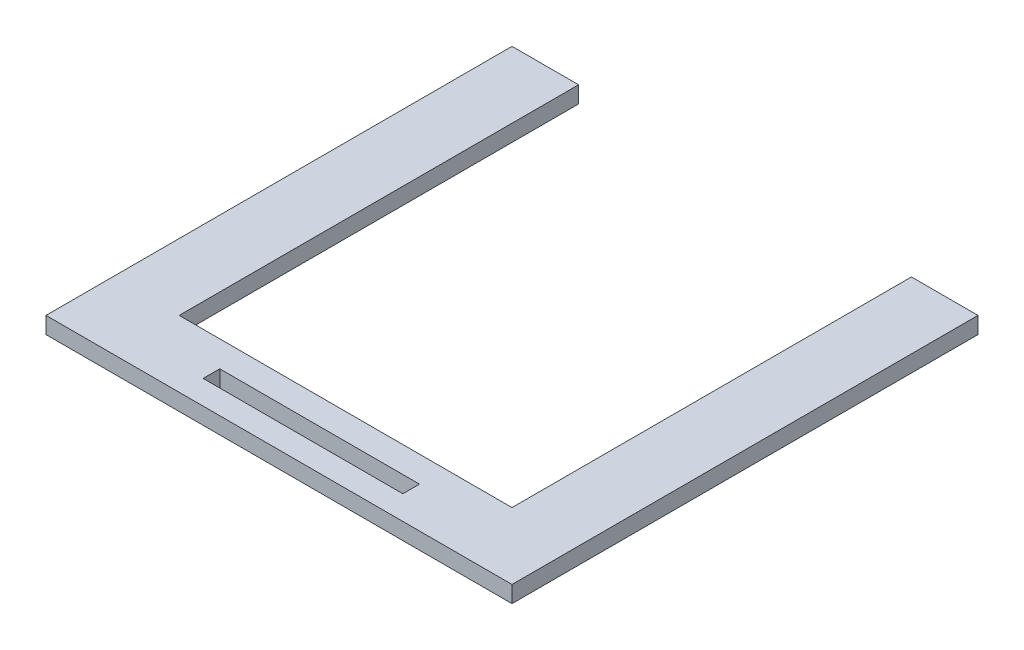
ISO-10303-21;
HEADER;
FILE_DESCRIPTION(('STEP AP214'),'2;1');
FILE_NAME('part.step','',(''),(''),'','','');
FILE_SCHEMA(('AUTOMOTIVE_DESIGN { 1 0 10303 214 1 1 1 1 }'));
ENDSEC;
DATA;
#1=APPLICATION_CONTEXT('core data for automotive mechanical design processes');
#2=APPLICATION_PROTOCOL_DEFINITION('international standard','automotive_design',2000,#1);
#3=PRODUCT_CONTEXT('',#1,'mechanical');
#4=PRODUCT('Part','Part','',(#3));
#5=PRODUCT_RELATED_PRODUCT_CATEGORY('part','',(#4));
#6=PRODUCT_DEFINITION_FORMATION('','',#4);
#7=PRODUCT_DEFINITION_CONTEXT('part definition',#1,'design');
#8=PRODUCT_DEFINITION('design','',#6,#7);
#9=PRODUCT_DEFINITION_SHAPE('','',#8);
#10=(LENGTH_UNIT() NAMED_UNIT(*) SI_UNIT(.MILLI.,.METRE.));
#11=(NAMED_UNIT(*) PLANE_ANGLE_UNIT() SI_UNIT($,.RADIAN.));
#12=(NAMED_UNIT(*) SI_UNIT($,.STERADIAN.) SOLID_ANGLE_UNIT());
#13=UNCERTAINTY_MEASURE_WITH_UNIT(LENGTH_MEASURE(1.E-05),#10,'distance_accuracy_value','');
#14=(GEOMETRIC_REPRESENTATION_CONTEXT(3) GLOBAL_UNCERTAINTY_ASSIGNED_CONTEXT((#13)) GLOBAL_UNIT_ASSIGNED_CONTEXT((#10,
#11,#12)) REPRESENTATION_CONTEXT('',''));
#15=CARTESIAN_POINT('',(0.,0.,0.));
#16=DIRECTION('',(0.,0.,1.));
#17=DIRECTION('',(1.,0.,0.));
#18=AXIS2_PLACEMENT_3D('',#15,#16,#17);
#19=CARTESIAN_POINT('',(32.0001996174094,3.175,-37.8874677482201));
#20=DIRECTION('',(1.,0.,0.));
#21=DIRECTION('',(0.,0.,-1.));
#22=AXIS2_PLACEMENT_3D('',#19,#20,#21);
#23=PLANE('',#22);
#24=DIRECTION('',(0.,0.,1.));
#25=VECTOR('',#24,1.);
#26=CARTESIAN_POINT('',(32.0001996174094,0.,-37.8874677482201));
#27=LINE('',#26,#25);
#28=CARTESIAN_POINT('',(32.0001996174094,0.,-37.8874677482201));
#29=VERTEX_POINT('',#28);
#30=CARTESIAN_POINT('',(32.0001996174095,0.,38.3125322517799));
#31=VERTEX_POINT('',#30);
#32=EDGE_CURVE('E171',#29,#31,#27,.T.);
#33=ORIENTED_EDGE('',*,*,#32,.T.);
#34=DIRECTION('',(0.,-1.,0.));
#35=VECTOR('',#34,1.);
#36=CARTESIAN_POINT('',(32.0001996174095,3.175,38.3125322517799));
#37=LINE('',#36,#35);
#38=CARTESIAN_POINT('',(32.0001996174095,3.175,38.3125322517799));
#39=VERTEX_POINT('',#38);
#40=EDGE_CURVE('E11',#39,#31,#37,.T.);
#41=ORIENTED_EDGE('',*,*,#40,.F.);
#42=DIRECTION('',(0.,0.,1.));
#43=VECTOR('',#42,1.);
#44=CARTESIAN_POINT('',(32.0001996174094,3.175,-37.8874677482201));
#45=LINE('',#44,#43);
#46=CARTESIAN_POINT('',(32.0001996174094,3.175,-37.8874677482201));
#47=VERTEX_POINT('',#46);
#48=EDGE_CURVE('E177',#47,#39,#45,.T.);
#49=ORIENTED_EDGE('',*,*,#48,.F.);
#50=DIRECTION('',(0.,-1.,0.));
#51=VECTOR('',#50,1.);
#52=CARTESIAN_POINT('',(32.0001996174094,3.175,-37.8874677482201));
#53=LINE('',#52,#51);
#54=EDGE_CURVE('E203',#47,#29,#53,.T.);
#55=ORIENTED_EDGE('',*,*,#54,.T.);
#56=EDGE_LOOP('',(#33,#41,#49,#55));
#57=FACE_BOUND('',#56,.T.);
#58=ADVANCED_FACE('F39',(#57),#23,.F.);
#59=CARTESIAN_POINT('',(-31.4998003825905,3.175,38.3125322517799));
#60=DIRECTION('',(0.,0.,1.));
#61=DIRECTION('',(1.,0.,0.));
#62=AXIS2_PLACEMENT_3D('',#59,#60,#61);
#63=PLANE('',#62);
#64=DIRECTION('',(-1.,0.,0.));
#65=VECTOR('',#64,1.);
#66=CARTESIAN_POINT('',(-31.4998003825905,0.,38.3125322517799));
#67=LINE('',#66,#65);
#68=CARTESIAN_POINT('',(-31.4998003825905,0.,38.3125322517799));
#69=VERTEX_POINT('',#68);
#70=EDGE_CURVE('E207',#31,#69,#67,.T.);
#71=ORIENTED_EDGE('',*,*,#70,.T.);
#72=DIRECTION('',(0.,-1.,0.));
#73=VECTOR('',#72,1.);
#74=CARTESIAN_POINT('',(-31.4998003825905,3.175,38.3125322517799));
#75=LINE('',#74,#73);
#76=CARTESIAN_POINT('',(-31.4998003825905,3.175,38.3125322517799));
#77=VERTEX_POINT('',#76);
#78=EDGE_CURVE('E47',#77,#69,#75,.T.);
#79=ORIENTED_EDGE('',*,*,#78,.F.);
#80=DIRECTION('',(-1.,0.,0.));
#81=VECTOR('',#80,1.);
#82=CARTESIAN_POINT('',(-31.4998003825905,3.175,38.3125322517799));
#83=LINE('',#82,#81);
#84=EDGE_CURVE('E181',#39,#77,#83,.T.);
#85=ORIENTED_EDGE('',*,*,#84,.F.);
#86=ORIENTED_EDGE('',*,*,#40,.T.);
#87=EDGE_LOOP('',(#71,#79,#85,#86));
#88=FACE_BOUND('',#87,.T.);
#89=ADVANCED_FACE('F277',(#88),#63,.F.);
#90=CARTESIAN_POINT('',(-31.4998003825905,3.175,-37.8874677482201));
#91=DIRECTION('',(-1.,0.,0.));
#92=DIRECTION('',(0.,0.,1.));
#93=AXIS2_PLACEMENT_3D('',#90,#91,#92);
#94=PLANE('',#93);
#95=DIRECTION('',(0.,0.,-1.));
#96=VECTOR('',#95,1.);
#97=CARTESIAN_POINT('',(-31.4998003825905,0.,-37.8874677482201));
#98=LINE('',#97,#96);
#99=CARTESIAN_POINT('',(-31.4998003825905,0.,-37.8874677482201));
#100=VERTEX_POINT('',#99);
#101=EDGE_CURVE('E210',#69,#100,#98,.T.);
#102=ORIENTED_EDGE('',*,*,#101,.T.);
#103=DIRECTION('',(0.,-1.,0.));
#104=VECTOR('',#103,1.);
#105=CARTESIAN_POINT('',(-31.4998003825905,3.175,-37.8874677482201));
#106=LINE('',#105,#104);
#107=CARTESIAN_POINT('',(-31.4998003825905,3.175,-37.8874677482201));
#108=VERTEX_POINT('',#107);
#109=EDGE_CURVE('E248',#108,#100,#106,.T.);
#110=ORIENTED_EDGE('',*,*,#109,.F.);
#111=DIRECTION('',(0.,0.,-1.));
#112=VECTOR('',#111,1.);
#113=CARTESIAN_POINT('',(-31.4998003825905,3.175,-37.8874677482201));
#114=LINE('',#113,#112);
#115=EDGE_CURVE('E185',#77,#108,#114,.T.);
#116=ORIENTED_EDGE('',*,*,#115,.F.);
#117=ORIENTED_EDGE('',*,*,#78,.T.);
#118=EDGE_LOOP('',(#102,#110,#116,#117));
#119=FACE_BOUND('',#118,.T.);
#120=ADVANCED_FACE('F257',(#119),#94,.F.);
#121=CARTESIAN_POINT('',(-44.1998003825905,3.175,-37.8874677482201));
#122=DIRECTION('',(0.,0.,1.));
#123=DIRECTION('',(1.,0.,0.));
#124=AXIS2_PLACEMENT_3D('',#121,#122,#123);
#125=PLANE('',#124);
#126=DIRECTION('',(-1.,0.,0.));
#127=VECTOR('',#126,1.);
#128=CARTESIAN_POINT('',(-44.1998003825905,0.,-37.8874677482201));
#129=LINE('',#128,#127);
#130=CARTESIAN_POINT('',(-44.1998003825905,0.,-37.8874677482201));
#131=VERTEX_POINT('',#130);
#132=EDGE_CURVE('E213',#100,#131,#129,.T.);
#133=ORIENTED_EDGE('',*,*,#132,.T.);
#134=DIRECTION('',(0.,-1.,0.));
#135=VECTOR('',#134,1.);
#136=CARTESIAN_POINT('',(-44.1998003825905,3.175,-37.8874677482201));
#137=LINE('',#136,#135);
#138=CARTESIAN_POINT('',(-44.1998003825905,3.175,-37.8874677482201));
#139=VERTEX_POINT('',#138);
#140=EDGE_CURVE('E244',#139,#131,#137,.T.);
#141=ORIENTED_EDGE('',*,*,#140,.F.);
#142=DIRECTION('',(-1.,0.,0.));
#143=VECTOR('',#142,1.);
#144=CARTESIAN_POINT('',(-44.1998003825905,3.175,-37.8874677482201));
#145=LINE('',#144,#143);
#146=EDGE_CURVE('E188',#108,#139,#145,.T.);
#147=ORIENTED_EDGE('',*,*,#146,.F.);
#148=ORIENTED_EDGE('',*,*,#109,.T.);
#149=EDGE_LOOP('',(#133,#141,#147,#148));
#150=FACE_BOUND('',#149,.T.);
#151=ADVANCED_FACE('F265',(#150),#125,.F.);
#152=CARTESIAN_POINT('',(-44.1998003825905,3.175,38.3125322517799));
#153=DIRECTION('',(1.,0.,0.));
#154=DIRECTION('',(0.,0.,-1.));
#155=AXIS2_PLACEMENT_3D('',#152,#153,#154);
#156=PLANE('',#155);
#157=DIRECTION('',(0.,0.,1.));
#158=VECTOR('',#157,1.);
#159=CARTESIAN_POINT('',(-44.1998003825905,0.,38.3125322517799));
#160=LINE('',#159,#158);
#161=CARTESIAN_POINT('',(-44.1998003825905,0.,51.0125322517799));
#162=VERTEX_POINT('',#161);
#163=EDGE_CURVE('E217',#131,#162,#160,.T.);
#164=ORIENTED_EDGE('',*,*,#163,.T.);
#165=DIRECTION('',(0.,-1.,0.));
#166=VECTOR('',#165,1.);
#167=CARTESIAN_POINT('',(-44.1998003825905,3.175,51.0125322517799));
#168=LINE('',#167,#166);
#169=CARTESIAN_POINT('',(-44.1998003825905,3.175,51.0125322517799));
#170=VERTEX_POINT('',#169);
#171=EDGE_CURVE('E240',#170,#162,#168,.T.);
#172=ORIENTED_EDGE('',*,*,#171,.F.);
#173=DIRECTION('',(0.,0.,1.));
#174=VECTOR('',#173,1.);
#175=CARTESIAN_POINT('',(-44.1998003825905,3.175,-37.8874677482201));
#176=LINE('',#175,#174);
#177=EDGE_CURVE('E191',#139,#170,#176,.T.);
#178=ORIENTED_EDGE('',*,*,#177,.F.);
#179=ORIENTED_EDGE('',*,*,#140,.T.);
#180=EDGE_LOOP('',(#164,#172,#178,#179));
#181=FACE_BOUND('',#180,.T.);
#182=ADVANCED_FACE('F269',(#181),#156,.F.);
#183=CARTESIAN_POINT('',(-44.1998003825905,3.175,51.0125322517799));
#184=DIRECTION('',(0.,0.,-1.));
#185=DIRECTION('',(-1.,0.,0.));
#186=AXIS2_PLACEMENT_3D('',#183,#184,#185);
#187=PLANE('',#186);
#188=DIRECTION('',(1.,0.,0.));
#189=VECTOR('',#188,1.);
#190=CARTESIAN_POINT('',(-44.1998003825905,0.,51.0125322517799));
#191=LINE('',#190,#189);
#192=CARTESIAN_POINT('',(44.7001996174095,0.,51.0125322517799));
#193=VERTEX_POINT('',#192);
#194=EDGE_CURVE('E220',#162,#193,#191,.T.);
#195=ORIENTED_EDGE('',*,*,#194,.T.);
#196=DIRECTION('',(0.,-1.,0.));
#197=VECTOR('',#196,1.);
#198=CARTESIAN_POINT('',(44.7001996174095,3.175,51.0125322517799));
#199=LINE('',#198,#197);
#200=CARTESIAN_POINT('',(44.7001996174095,3.175,51.0125322517799));
#201=VERTEX_POINT('',#200);
#202=EDGE_CURVE('E236',#201,#193,#199,.T.);
#203=ORIENTED_EDGE('',*,*,#202,.F.);
#204=DIRECTION('',(1.,0.,0.));
#205=VECTOR('',#204,1.);
#206=CARTESIAN_POINT('',(-44.1998003825905,3.175,51.0125322517799));
#207=LINE('',#206,#205);
#208=EDGE_CURVE('E194',#170,#201,#207,.T.);
#209=ORIENTED_EDGE('',*,*,#208,.F.);
#210=ORIENTED_EDGE('',*,*,#171,.T.);
#211=EDGE_LOOP('',(#195,#203,#209,#210));
#212=FACE_BOUND('',#211,.T.);
#213=ADVANCED_FACE('F289',(#212),#187,.F.);
#214=CARTESIAN_POINT('',(44.7001996174094,3.175,-37.8874677482201));
#215=DIRECTION('',(-1.,0.,0.));
#216=DIRECTION('',(0.,0.,1.));
#217=AXIS2_PLACEMENT_3D('',#214,#215,#216);
#218=PLANE('',#217);
#219=DIRECTION('',(0.,0.,-1.));
#220=VECTOR('',#219,1.);
#221=CARTESIAN_POINT('',(44.7001996174094,0.,-37.8874677482201));
#222=LINE('',#221,#220);
#223=CARTESIAN_POINT('',(44.7001996174094,0.,-37.8874677482201));
#224=VERTEX_POINT('',#223);
#225=EDGE_CURVE('E224',#193,#224,#222,.T.);
#226=ORIENTED_EDGE('',*,*,#225,.T.);
#227=DIRECTION('',(0.,-1.,0.));
#228=VECTOR('',#227,1.);
#229=CARTESIAN_POINT('',(44.7001996174094,3.175,-37.8874677482201));
#230=LINE('',#229,#228);
#231=CARTESIAN_POINT('',(44.7001996174094,3.175,-37.8874677482201));
#232=VERTEX_POINT('',#231);
#233=EDGE_CURVE('E232',#232,#224,#230,.T.);
#234=ORIENTED_EDGE('',*,*,#233,.F.);
#235=DIRECTION('',(0.,0.,-1.));
#236=VECTOR('',#235,1.);
#237=CARTESIAN_POINT('',(44.7001996174095,3.175,38.3125322517799));
#238=LINE('',#237,#236);
#239=EDGE_CURVE('E197',#201,#232,#238,.T.);
#240=ORIENTED_EDGE('',*,*,#239,.F.);
#241=ORIENTED_EDGE('',*,*,#202,.T.);
#242=EDGE_LOOP('',(#226,#234,#240,#241));
#243=FACE_BOUND('',#242,.T.);
#244=ADVANCED_FACE('F287',(#243),#218,.F.);
#245=CARTESIAN_POINT('',(32.0001996174094,3.175,-37.8874677482201));
#246=DIRECTION('',(0.,0.,1.));
#247=DIRECTION('',(1.,0.,0.));
#248=AXIS2_PLACEMENT_3D('',#245,#246,#247);
#249=PLANE('',#248);
#250=DIRECTION('',(-1.,0.,0.));
#251=VECTOR('',#250,1.);
#252=CARTESIAN_POINT('',(32.0001996174094,0.,-37.8874677482201));
#253=LINE('',#252,#251);
#254=EDGE_CURVE('E182',#224,#29,#253,.T.);
#255=ORIENTED_EDGE('',*,*,#254,.T.);
#256=ORIENTED_EDGE('',*,*,#54,.F.);
#257=DIRECTION('',(-1.,0.,0.));
#258=VECTOR('',#257,1.);
#259=CARTESIAN_POINT('',(32.0001996174094,3.175,-37.8874677482201));
#260=LINE('',#259,#258);
#261=EDGE_CURVE('E200',#232,#47,#260,.T.);
#262=ORIENTED_EDGE('',*,*,#261,.F.);
#263=ORIENTED_EDGE('',*,*,#233,.T.);
#264=EDGE_LOOP('',(#255,#256,#262,#263));
#265=FACE_BOUND('',#264,.T.);
#266=ADVANCED_FACE('F282',(#265),#249,.F.);
#267=CARTESIAN_POINT('',(0.,3.175,0.));
#268=DIRECTION('',(0.,1.,0.));
#269=DIRECTION('',(0.,0.,1.));
#270=AXIS2_PLACEMENT_3D('',#267,#268,#269);
#271=PLANE('',#270);
#272=DIRECTION('',(0.,0.,1.));
#273=VECTOR('',#272,1.);
#274=CARTESIAN_POINT('',(-18.7998003825905,3.175,43.2655322517799));
#275=LINE('',#274,#273);
#276=CARTESIAN_POINT('',(-18.7998003825905,3.175,43.2655322517799));
#277=VERTEX_POINT('',#276);
#278=CARTESIAN_POINT('',(-18.7998003825905,3.175,46.4405322517799));
#279=VERTEX_POINT('',#278);
#280=EDGE_CURVE('E54',#277,#279,#275,.T.);
#281=ORIENTED_EDGE('',*,*,#280,.F.);
#282=DIRECTION('',(-1.,0.,0.));
#283=VECTOR('',#282,1.);
#284=CARTESIAN_POINT('',(-18.7998003825905,3.175,43.2655322517799));
#285=LINE('',#284,#283);
#286=CARTESIAN_POINT('',(19.3001996174094,3.175,43.2655322517799));
#287=VERTEX_POINT('',#286);
#288=EDGE_CURVE('E149',#287,#277,#285,.T.);
#289=ORIENTED_EDGE('',*,*,#288,.F.);
#290=DIRECTION('',(0.,0.,-1.));
#291=VECTOR('',#290,1.);
#292=CARTESIAN_POINT('',(19.3001996174094,3.175,43.2655322517799));
#293=LINE('',#292,#291);
#294=CARTESIAN_POINT('',(19.3001996174094,3.175,46.4405322517799));
#295=VERTEX_POINT('',#294);
#296=EDGE_CURVE('E153',#295,#287,#293,.T.);
#297=ORIENTED_EDGE('',*,*,#296,.F.);
#298=DIRECTION('',(1.,0.,0.));
#299=VECTOR('',#298,1.);
#300=CARTESIAN_POINT('',(-18.7998003825905,3.175,46.4405322517799));
#301=LINE('',#300,#299);
#302=EDGE_CURVE('E162',#279,#295,#301,.T.);
#303=ORIENTED_EDGE('',*,*,#302,.F.);
#304=EDGE_LOOP('',(#281,#289,#297,#303));
#305=FACE_BOUND('',#304,.T.);
#306=ORIENTED_EDGE('',*,*,#48,.T.);
#307=ORIENTED_EDGE('',*,*,#84,.T.);
#308=ORIENTED_EDGE('',*,*,#115,.T.);
#309=ORIENTED_EDGE('',*,*,#146,.T.);
#310=ORIENTED_EDGE('',*,*,#177,.T.);
#311=ORIENTED_EDGE('',*,*,#208,.T.);
#312=ORIENTED_EDGE('',*,*,#239,.T.);
#313=ORIENTED_EDGE('',*,*,#261,.T.);
#314=EDGE_LOOP('',(#306,#307,#308,#309,#310,#311,#312,#313));
#315=FACE_BOUND('',#314,.T.);
#316=ADVANCED_FACE('F273',(#305,#315),#271,.T.);
#317=CARTESIAN_POINT('',(0.,0.,0.));
#318=DIRECTION('',(0.,1.,0.));
#319=DIRECTION('',(0.,0.,1.));
#320=AXIS2_PLACEMENT_3D('',#317,#318,#319);
#321=PLANE('',#320);
#322=DIRECTION('',(-1.,0.,0.));
#323=VECTOR('',#322,1.);
#324=CARTESIAN_POINT('',(-18.7998003825905,0.,43.2655322517799));
#325=LINE('',#324,#323);
#326=CARTESIAN_POINT('',(19.3001996174094,0.,43.2655322517799));
#327=VERTEX_POINT('',#326);
#328=CARTESIAN_POINT('',(-18.7998003825905,0.,43.2655322517799));
#329=VERTEX_POINT('',#328);
#330=EDGE_CURVE('E137',#327,#329,#325,.T.);
#331=ORIENTED_EDGE('',*,*,#330,.T.);
#332=DIRECTION('',(0.,0.,1.));
#333=VECTOR('',#332,1.);
#334=CARTESIAN_POINT('',(-18.7998003825905,0.,43.2655322517799));
#335=LINE('',#334,#333);
#336=CARTESIAN_POINT('',(-18.7998003825905,0.,46.4405322517799));
#337=VERTEX_POINT('',#336);
#338=EDGE_CURVE('E130',#329,#337,#335,.T.);
#339=ORIENTED_EDGE('',*,*,#338,.T.);
#340=DIRECTION('',(1.,0.,0.));
#341=VECTOR('',#340,1.);
#342=CARTESIAN_POINT('',(-18.7998003825905,0.,46.4405322517799));
#343=LINE('',#342,#341);
#344=CARTESIAN_POINT('',(19.3001996174094,0.,46.4405322517799));
#345=VERTEX_POINT('',#344);
#346=EDGE_CURVE('E140',#337,#345,#343,.T.);
#347=ORIENTED_EDGE('',*,*,#346,.T.);
#348=DIRECTION('',(0.,0.,-1.));
#349=VECTOR('',#348,1.);
#350=CARTESIAN_POINT('',(19.3001996174094,0.,43.2655322517799));
#351=LINE('',#350,#349);
#352=EDGE_CURVE('E62',#345,#327,#351,.T.);
#353=ORIENTED_EDGE('',*,*,#352,.T.);
#354=EDGE_LOOP('',(#331,#339,#347,#353));
#355=FACE_BOUND('',#354,.T.);
#356=ORIENTED_EDGE('',*,*,#32,.F.);
#357=ORIENTED_EDGE('',*,*,#254,.F.);
#358=ORIENTED_EDGE('',*,*,#225,.F.);
#359=ORIENTED_EDGE('',*,*,#194,.F.);
#360=ORIENTED_EDGE('',*,*,#163,.F.);
#361=ORIENTED_EDGE('',*,*,#132,.F.);
#362=ORIENTED_EDGE('',*,*,#101,.F.);
#363=ORIENTED_EDGE('',*,*,#70,.F.);
#364=EDGE_LOOP('',(#356,#357,#358,#359,#360,#361,#362,#363));
#365=FACE_BOUND('',#364,.T.);
#366=ADVANCED_FACE('F145',(#355,#365),#321,.F.);
#367=CARTESIAN_POINT('',(-18.7998003825905,0.,43.2655322517799));
#368=DIRECTION('',(-1.,0.,0.));
#369=DIRECTION('',(0.,0.,1.));
#370=AXIS2_PLACEMENT_3D('',#367,#368,#369);
#371=PLANE('',#370);
#372=ORIENTED_EDGE('',*,*,#280,.T.);
#373=DIRECTION('',(0.,1.,0.));
#374=VECTOR('',#373,1.);
#375=CARTESIAN_POINT('',(-18.7998003825905,0.,46.4405322517799));
#376=LINE('',#375,#374);
#377=EDGE_CURVE('E126',#337,#279,#376,.T.);
#378=ORIENTED_EDGE('',*,*,#377,.F.);
#379=ORIENTED_EDGE('',*,*,#338,.F.);
#380=DIRECTION('',(0.,1.,0.));
#381=VECTOR('',#380,1.);
#382=CARTESIAN_POINT('',(-18.7998003825905,0.,43.2655322517799));
#383=LINE('',#382,#381);
#384=EDGE_CURVE('E168',#329,#277,#383,.T.);
#385=ORIENTED_EDGE('',*,*,#384,.T.);
#386=EDGE_LOOP('',(#372,#378,#379,#385));
#387=FACE_BOUND('',#386,.T.);
#388=ADVANCED_FACE('F128',(#387),#371,.F.);
#389=CARTESIAN_POINT('',(-18.7998003825905,0.,43.2655322517799));
#390=DIRECTION('',(0.,0.,-1.));
#391=DIRECTION('',(-1.,0.,0.));
#392=AXIS2_PLACEMENT_3D('',#389,#390,#391);
#393=PLANE('',#392);
#394=ORIENTED_EDGE('',*,*,#288,.T.);
#395=ORIENTED_EDGE('',*,*,#384,.F.);
#396=ORIENTED_EDGE('',*,*,#330,.F.);
#397=DIRECTION('',(0.,1.,0.));
#398=VECTOR('',#397,1.);
#399=CARTESIAN_POINT('',(19.3001996174094,0.,43.2655322517799));
#400=LINE('',#399,#398);
#401=EDGE_CURVE('E172',#327,#287,#400,.T.);
#402=ORIENTED_EDGE('',*,*,#401,.T.);
#403=EDGE_LOOP('',(#394,#395,#396,#402));
#404=FACE_BOUND('',#403,.T.);
#405=ADVANCED_FACE('F362',(#404),#393,.F.);
#406=CARTESIAN_POINT('',(19.3001996174094,0.,43.2655322517799));
#407=DIRECTION('',(1.,0.,0.));
#408=DIRECTION('',(0.,0.,-1.));
#409=AXIS2_PLACEMENT_3D('',#406,#407,#408);
#410=PLANE('',#409);
#411=ORIENTED_EDGE('',*,*,#296,.T.);
#412=ORIENTED_EDGE('',*,*,#401,.F.);
#413=ORIENTED_EDGE('',*,*,#352,.F.);
#414=DIRECTION('',(0.,1.,0.));
#415=VECTOR('',#414,1.);
#416=CARTESIAN_POINT('',(19.3001996174094,0.,46.4405322517799));
#417=LINE('',#416,#415);
#418=EDGE_CURVE('E136',#345,#295,#417,.T.);
#419=ORIENTED_EDGE('',*,*,#418,.T.);
#420=EDGE_LOOP('',(#411,#412,#413,#419));
#421=FACE_BOUND('',#420,.T.);
#422=ADVANCED_FACE('F371',(#421),#410,.F.);
#423=CARTESIAN_POINT('',(-18.7998003825905,0.,46.4405322517799));
#424=DIRECTION('',(0.,0.,1.));
#425=DIRECTION('',(1.,0.,0.));
#426=AXIS2_PLACEMENT_3D('',#423,#424,#425);
#427=PLANE('',#426);
#428=ORIENTED_EDGE('',*,*,#302,.T.);
#429=ORIENTED_EDGE('',*,*,#418,.F.);
#430=ORIENTED_EDGE('',*,*,#346,.F.);
#431=ORIENTED_EDGE('',*,*,#377,.T.);
#432=EDGE_LOOP('',(#428,#429,#430,#431));
#433=FACE_BOUND('',#432,.T.);
#434=ADVANCED_FACE('F141',(#433),#427,.F.);
#435=CLOSED_SHELL('',(#58,#89,#120,#151,#182,#213,#244,#266,#316,#366,#388,#405,#422,#434));
#436=MANIFOLD_SOLID_BREP('B2',#435);
#437=ADVANCED_BREP_SHAPE_REPRESENTATION('',(#18,#436),#14);
#438=SHAPE_DEFINITION_REPRESENTATION(#9,#437);
ENDSEC;
END-ISO-10303-21;
